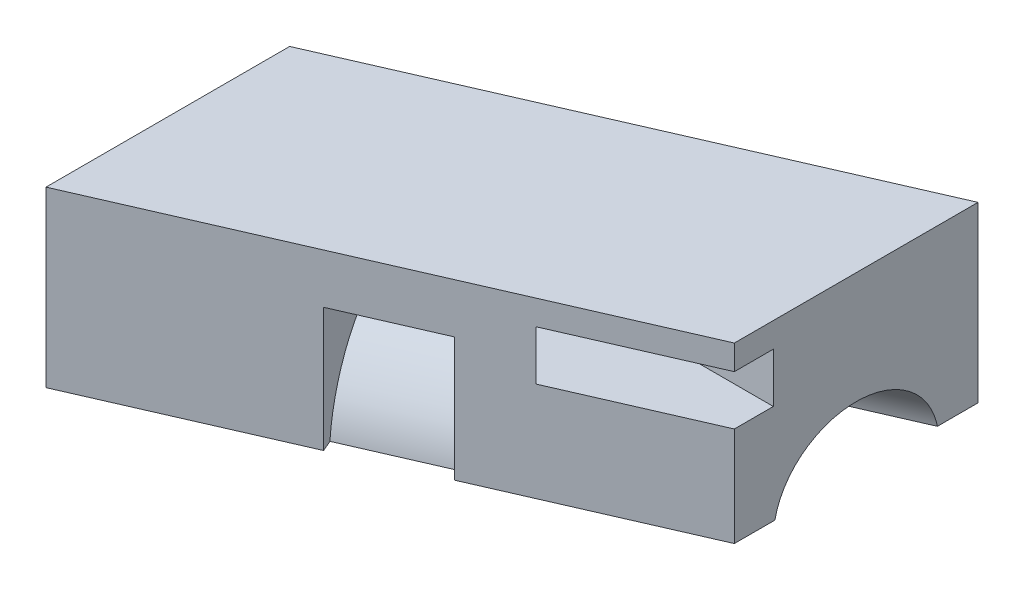
ISO-10303-21;
HEADER;
FILE_DESCRIPTION(('STEP AP214'),'2;1');
FILE_NAME('part.step','',(''),(''),'','','');
FILE_SCHEMA(('AUTOMOTIVE_DESIGN { 1 0 10303 214 1 1 1 1 }'));
ENDSEC;
DATA;
#1=APPLICATION_CONTEXT('core data for automotive mechanical design processes');
#2=APPLICATION_PROTOCOL_DEFINITION('international standard','automotive_design',2000,#1);
#3=PRODUCT_CONTEXT('',#1,'mechanical');
#4=PRODUCT('Part','Part','',(#3));
#5=PRODUCT_RELATED_PRODUCT_CATEGORY('part','',(#4));
#6=PRODUCT_DEFINITION_FORMATION('','',#4);
#7=PRODUCT_DEFINITION_CONTEXT('part definition',#1,'design');
#8=PRODUCT_DEFINITION('design','',#6,#7);
#9=PRODUCT_DEFINITION_SHAPE('','',#8);
#10=(LENGTH_UNIT() NAMED_UNIT(*) SI_UNIT(.MILLI.,.METRE.));
#11=(NAMED_UNIT(*) PLANE_ANGLE_UNIT() SI_UNIT($,.RADIAN.));
#12=(NAMED_UNIT(*) SI_UNIT($,.STERADIAN.) SOLID_ANGLE_UNIT());
#13=UNCERTAINTY_MEASURE_WITH_UNIT(LENGTH_MEASURE(1.E-05),#10,'distance_accuracy_value','');
#14=(GEOMETRIC_REPRESENTATION_CONTEXT(3) GLOBAL_UNCERTAINTY_ASSIGNED_CONTEXT((#13)) GLOBAL_UNIT_ASSIGNED_CONTEXT((#10,
#11,#12)) REPRESENTATION_CONTEXT('',''));
#15=CARTESIAN_POINT('',(0.,0.,0.));
#16=DIRECTION('',(0.,0.,1.));
#17=DIRECTION('',(1.,0.,0.));
#18=AXIS2_PLACEMENT_3D('',#15,#16,#17);
#19=CARTESIAN_POINT('',(0.,-7.,0.));
#20=DIRECTION('',(0.,1.,0.));
#21=DIRECTION('',(0.,0.,-1.));
#22=AXIS2_PLACEMENT_3D('',#19,#20,#21);
#23=PLANE('',#22);
#24=DIRECTION('',(0.,0.,-1.));
#25=VECTOR('',#24,1.);
#26=CARTESIAN_POINT('',(0.,-7.,0.));
#27=LINE('',#26,#25);
#28=CARTESIAN_POINT('',(0.,-7.,0.));
#29=VERTEX_POINT('',#28);
#30=CARTESIAN_POINT('',(0.,-7.,-1.63663417676994));
#31=VERTEX_POINT('',#30);
#32=EDGE_CURVE('E195',#29,#31,#27,.T.);
#33=ORIENTED_EDGE('',*,*,#32,.T.);
#34=DIRECTION('',(-0.916515138991168,0.,0.4));
#35=VECTOR('',#34,1.);
#36=CARTESIAN_POINT('',(28.2702268782218,-7.,-13.9747727084868));
#37=LINE('',#36,#35);
#38=CARTESIAN_POINT('',(19.3128784747792,-7.,-10.0654653670708));
#39=VERTEX_POINT('',#38);
#40=EDGE_CURVE('E318',#39,#31,#37,.T.);
#41=ORIENTED_EDGE('',*,*,#40,.F.);
#42=DIRECTION('',(0.,0.,1.));
#43=VECTOR('',#42,1.);
#44=CARTESIAN_POINT('',(19.3128784747792,-7.,-18.2486362509205));
#45=LINE('',#44,#43);
#46=CARTESIAN_POINT('',(19.3128784747792,-7.,-8.42883119030086));
#47=VERTEX_POINT('',#46);
#48=EDGE_CURVE('E227',#39,#47,#45,.T.);
#49=ORIENTED_EDGE('',*,*,#48,.T.);
#50=DIRECTION('',(0.916515138991168,0.,-0.4));
#51=VECTOR('',#50,1.);
#52=CARTESIAN_POINT('',(22.9128784747792,-7.,-10.));
#53=LINE('',#52,#51);
#54=CARTESIAN_POINT('',(11.4564392373896,-7.,-5.00000000000001));
#55=VERTEX_POINT('',#54);
#56=EDGE_CURVE('E200',#55,#47,#53,.T.);
#57=ORIENTED_EDGE('',*,*,#56,.F.);
#58=DIRECTION('',(0.4,0.,0.916515138991168));
#59=VECTOR('',#58,1.);
#60=CARTESIAN_POINT('',(11.2614314492087,-7.,-5.44681897522243));
#61=LINE('',#60,#59);
#62=CARTESIAN_POINT('',(11.2614314492087,-7.,-5.44681897522243));
#63=VERTEX_POINT('',#62);
#64=EDGE_CURVE('E302',#63,#55,#61,.T.);
#65=ORIENTED_EDGE('',*,*,#64,.F.);
#66=DIRECTION('',(0.916515138991168,0.,-0.4));
#67=VECTOR('',#66,1.);
#68=CARTESIAN_POINT('',(7.59537089324404,-7.,-3.84681897522243));
#69=LINE('',#68,#67);
#70=CARTESIAN_POINT('',(7.59537089324404,-7.,-3.84681897522243));
#71=VERTEX_POINT('',#70);
#72=EDGE_CURVE('E300',#71,#63,#69,.T.);
#73=ORIENTED_EDGE('',*,*,#72,.F.);
#74=DIRECTION('',(0.4,0.,0.916515138991168));
#75=VECTOR('',#74,1.);
#76=CARTESIAN_POINT('',(7.59537089324404,-7.,-3.84681897522243));
#77=LINE('',#76,#75);
#78=CARTESIAN_POINT('',(7.79037868142493,-7.,-3.40000000000001));
#79=VERTEX_POINT('',#78);
#80=EDGE_CURVE('E198',#71,#79,#77,.T.);
#81=ORIENTED_EDGE('',*,*,#80,.T.);
#82=EDGE_CURVE('E182',#29,#79,#53,.T.);
#83=ORIENTED_EDGE('',*,*,#82,.F.);
#84=EDGE_LOOP('',(#33,#41,#49,#57,#65,#73,#81,#83));
#85=FACE_BOUND('',#84,.T.);
#86=ADVANCED_FACE('F32',(#85),#23,.F.);
#87=CARTESIAN_POINT('',(0.,-7.,-8.18317088384971));
#88=VERTEX_POINT('',#87);
#89=CARTESIAN_POINT('',(0.,-7.,-9.81980506061964));
#90=VERTEX_POINT('',#89);
#91=EDGE_CURVE('E207',#88,#90,#27,.T.);
#92=ORIENTED_EDGE('',*,*,#91,.T.);
#93=DIRECTION('',(-0.916515138991168,0.,0.4));
#94=VECTOR('',#93,1.);
#95=CARTESIAN_POINT('',(-3.6,-7.,-8.2486362509205));
#96=LINE('',#95,#94);
#97=CARTESIAN_POINT('',(4.19037868142494,-7.,-11.6486362509205));
#98=VERTEX_POINT('',#97);
#99=EDGE_CURVE('E199',#98,#90,#96,.T.);
#100=ORIENTED_EDGE('',*,*,#99,.F.);
#101=DIRECTION('',(0.400000000000001,0.,0.916515138991168));
#102=VECTOR('',#101,1.);
#103=CARTESIAN_POINT('',(4.38538646960582,-7.,-11.2018172756981));
#104=LINE('',#103,#102);
#105=CARTESIAN_POINT('',(4.38538646960582,-7.,-11.2018172756981));
#106=VERTEX_POINT('',#105);
#107=EDGE_CURVE('E297',#98,#106,#104,.T.);
#108=ORIENTED_EDGE('',*,*,#107,.T.);
#109=DIRECTION('',(0.916515138991168,0.,-0.4));
#110=VECTOR('',#109,1.);
#111=CARTESIAN_POINT('',(4.38538646960582,-7.,-11.2018172756981));
#112=LINE('',#111,#110);
#113=CARTESIAN_POINT('',(8.05144702557049,-7.,-12.8018172756981));
#114=VERTEX_POINT('',#113);
#115=EDGE_CURVE('E315',#106,#114,#112,.T.);
#116=ORIENTED_EDGE('',*,*,#115,.T.);
#117=DIRECTION('',(0.400000000000001,0.,0.916515138991168));
#118=VECTOR('',#117,1.);
#119=CARTESIAN_POINT('',(8.05144702557049,-7.,-12.8018172756981));
#120=LINE('',#119,#118);
#121=CARTESIAN_POINT('',(7.85643923738961,-7.,-13.2486362509205));
#122=VERTEX_POINT('',#121);
#123=EDGE_CURVE('E288',#122,#114,#120,.T.);
#124=ORIENTED_EDGE('',*,*,#123,.F.);
#125=CARTESIAN_POINT('',(19.3128784747792,-7.,-18.2486362509205));
#126=VERTEX_POINT('',#125);
#127=EDGE_CURVE('E190',#126,#122,#96,.T.);
#128=ORIENTED_EDGE('',*,*,#127,.F.);
#129=CARTESIAN_POINT('',(19.3128784747792,-7.,-16.6120020741506));
#130=VERTEX_POINT('',#129);
#131=EDGE_CURVE('E223',#126,#130,#45,.T.);
#132=ORIENTED_EDGE('',*,*,#131,.T.);
#133=DIRECTION('',(-0.916515138991168,0.,0.4));
#134=VECTOR('',#133,1.);
#135=CARTESIAN_POINT('',(25.8702268782218,-7.,-19.4738635424338));
#136=LINE('',#135,#134);
#137=EDGE_CURVE('E327',#130,#88,#136,.T.);
#138=ORIENTED_EDGE('',*,*,#137,.T.);
#139=EDGE_LOOP('',(#92,#100,#108,#116,#124,#128,#132,#138));
#140=FACE_BOUND('',#139,.T.);
#141=ADVANCED_FACE('F393',(#140),#23,.F.);
#142=CARTESIAN_POINT('',(0.,0.,0.));
#143=DIRECTION('',(0.,1.,0.));
#144=DIRECTION('',(0.,0.,-1.));
#145=AXIS2_PLACEMENT_3D('',#142,#143,#144);
#146=PLANE('',#145);
#147=DIRECTION('',(0.916515138991168,0.,-0.4));
#148=VECTOR('',#147,1.);
#149=CARTESIAN_POINT('',(22.9128784747792,0.,-10.));
#150=LINE('',#149,#148);
#151=CARTESIAN_POINT('',(0.,0.,0.));
#152=VERTEX_POINT('',#151);
#153=CARTESIAN_POINT('',(19.3128784747792,0.,-8.42883119030086));
#154=VERTEX_POINT('',#153);
#155=EDGE_CURVE('E185',#152,#154,#150,.T.);
#156=ORIENTED_EDGE('',*,*,#155,.T.);
#157=DIRECTION('',(0.,0.,1.));
#158=VECTOR('',#157,1.);
#159=CARTESIAN_POINT('',(19.3128784747792,0.,-18.2486362509205));
#160=LINE('',#159,#158);
#161=CARTESIAN_POINT('',(19.3128784747792,0.,-18.2486362509205));
#162=VERTEX_POINT('',#161);
#163=EDGE_CURVE('E222',#162,#154,#160,.T.);
#164=ORIENTED_EDGE('',*,*,#163,.F.);
#165=DIRECTION('',(-0.916515138991168,0.,0.4));
#166=VECTOR('',#165,1.);
#167=CARTESIAN_POINT('',(-3.6,0.,-8.2486362509205));
#168=LINE('',#167,#166);
#169=CARTESIAN_POINT('',(0.,0.,-9.81980506061964));
#170=VERTEX_POINT('',#169);
#171=EDGE_CURVE('E334',#162,#170,#168,.T.);
#172=ORIENTED_EDGE('',*,*,#171,.T.);
#173=DIRECTION('',(0.,0.,-1.));
#174=VECTOR('',#173,1.);
#175=CARTESIAN_POINT('',(0.,0.,0.));
#176=LINE('',#175,#174);
#177=EDGE_CURVE('E212',#152,#170,#176,.T.);
#178=ORIENTED_EDGE('',*,*,#177,.F.);
#179=EDGE_LOOP('',(#156,#164,#172,#178));
#180=FACE_BOUND('',#179,.T.);
#181=ADVANCED_FACE('F397',(#180),#146,.T.);
#182=CARTESIAN_POINT('',(27.0702268782218,-7.54999999999999,-16.7243181254603));
#183=DIRECTION('',(-0.916515138991168,0.,0.4));
#184=DIRECTION('',(0.4,0.,0.916515138991168));
#185=AXIS2_PLACEMENT_3D('',#182,#183,#184);
#186=CYLINDRICAL_SURFACE('',#185,3.04999999999999);
#187=CARTESIAN_POINT('',(0.,-7.54999999999999,-4.90990253030982));
#188=DIRECTION('',(1.,0.,0.));
#189=DIRECTION('',(0.,0.,1.));
#190=AXIS2_PLACEMENT_3D('',#187,#188,#189);
#191=ELLIPSE('',#190,3.32782282609888,3.04999999999999);
#192=EDGE_CURVE('E204',#31,#88,#191,.F.);
#193=ORIENTED_EDGE('',*,*,#192,.T.);
#194=ORIENTED_EDGE('',*,*,#137,.F.);
#195=CARTESIAN_POINT('',(19.3128784747792,-7.54999999999999,-13.3387337206107));
#196=DIRECTION('',(-1.,0.,0.));
#197=DIRECTION('',(0.,0.,1.));
#198=AXIS2_PLACEMENT_3D('',#195,#196,#197);
#199=ELLIPSE('',#198,3.32782282609888,3.04999999999999);
#200=EDGE_CURVE('E238',#130,#39,#199,.F.);
#201=ORIENTED_EDGE('',*,*,#200,.T.);
#202=ORIENTED_EDGE('',*,*,#40,.T.);
#203=EDGE_LOOP('',(#193,#194,#201,#202));
#204=FACE_BOUND('',#203,.T.);
#205=ADVANCED_FACE('F387',(#204),#186,.F.);
#206=CARTESIAN_POINT('',(-3.6,-1.,-6.));
#207=DIRECTION('',(0.,1.,0.));
#208=DIRECTION('',(0.,0.,-1.));
#209=AXIS2_PLACEMENT_3D('',#206,#207,#208);
#210=PLANE('',#209);
#211=DIRECTION('',(0.,0.,-1.));
#212=VECTOR('',#211,1.);
#213=CARTESIAN_POINT('',(0.,-1.,-6.));
#214=LINE('',#213,#212);
#215=CARTESIAN_POINT('',(0.,-1.,-6.));
#216=VERTEX_POINT('',#215);
#217=CARTESIAN_POINT('',(0.,-1.,-9.81980506061964));
#218=VERTEX_POINT('',#217);
#219=EDGE_CURVE('E218',#216,#218,#214,.T.);
#220=ORIENTED_EDGE('',*,*,#219,.T.);
#221=DIRECTION('',(0.916515138991168,0.,-0.4));
#222=VECTOR('',#221,1.);
#223=CARTESIAN_POINT('',(-3.6,-0.999999999999999,-8.2486362509205));
#224=LINE('',#223,#222);
#225=CARTESIAN_POINT('',(0.412878474779229,-1.,-10.));
#226=VERTEX_POINT('',#225);
#227=EDGE_CURVE('E279',#218,#226,#224,.T.);
#228=ORIENTED_EDGE('',*,*,#227,.T.);
#229=DIRECTION('',(1.,0.,0.));
#230=VECTOR('',#229,1.);
#231=CARTESIAN_POINT('',(-3.6,-1.,-10.));
#232=LINE('',#231,#230);
#233=CARTESIAN_POINT('',(19.3128784747792,-1.,-10.));
#234=VERTEX_POINT('',#233);
#235=EDGE_CURVE('E248',#226,#234,#232,.T.);
#236=ORIENTED_EDGE('',*,*,#235,.T.);
#237=DIRECTION('',(0.,0.,1.));
#238=VECTOR('',#237,1.);
#239=CARTESIAN_POINT('',(19.3128784747792,-1.,-6.));
#240=LINE('',#239,#238);
#241=CARTESIAN_POINT('',(19.3128784747792,-1.,-8.42883119030086));
#242=VERTEX_POINT('',#241);
#243=EDGE_CURVE('E235',#234,#242,#240,.T.);
#244=ORIENTED_EDGE('',*,*,#243,.T.);
#245=DIRECTION('',(-0.916515138991168,0.,0.4));
#246=VECTOR('',#245,1.);
#247=CARTESIAN_POINT('',(22.9128784747792,-1.,-10.));
#248=LINE('',#247,#246);
#249=CARTESIAN_POINT('',(13.7477270848675,-1.,-6.));
#250=VERTEX_POINT('',#249);
#251=EDGE_CURVE('E282',#242,#250,#248,.T.);
#252=ORIENTED_EDGE('',*,*,#251,.T.);
#253=DIRECTION('',(1.,0.,0.));
#254=VECTOR('',#253,1.);
#255=CARTESIAN_POINT('',(-3.6,-1.,-6.));
#256=LINE('',#255,#254);
#257=EDGE_CURVE('E240',#216,#250,#256,.T.);
#258=ORIENTED_EDGE('',*,*,#257,.F.);
#259=EDGE_LOOP('',(#220,#228,#236,#244,#252,#258));
#260=FACE_BOUND('',#259,.T.);
#261=ADVANCED_FACE('F353',(#260),#210,.F.);
#262=CARTESIAN_POINT('',(-3.6,-7.,-8.2486362509205));
#263=DIRECTION('',(0.4,0.,0.916515138991168));
#264=DIRECTION('',(0.916515138991168,0.,-0.4));
#265=AXIS2_PLACEMENT_3D('',#262,#263,#264);
#266=PLANE('',#265);
#267=DIRECTION('',(0.,1.,0.));
#268=VECTOR('',#267,1.);
#269=CARTESIAN_POINT('',(0.,-7.,-9.81980506061964));
#270=LINE('',#269,#268);
#271=CARTESIAN_POINT('',(0.,-3.,-9.81980506061964));
#272=VERTEX_POINT('',#271);
#273=EDGE_CURVE('E209',#90,#272,#270,.T.);
#274=ORIENTED_EDGE('',*,*,#273,.T.);
#275=DIRECTION('',(-0.916515138991168,0.,0.4));
#276=VECTOR('',#275,1.);
#277=CARTESIAN_POINT('',(-3.6,-3.,-8.2486362509205));
#278=LINE('',#277,#276);
#279=CARTESIAN_POINT('',(0.412878474779227,-3.,-10.));
#280=VERTEX_POINT('',#279);
#281=EDGE_CURVE('E265',#280,#272,#278,.T.);
#282=ORIENTED_EDGE('',*,*,#281,.F.);
#283=DIRECTION('',(0.,-1.,0.));
#284=VECTOR('',#283,1.);
#285=CARTESIAN_POINT('',(0.412878474779228,-7.,-10.));
#286=LINE('',#285,#284);
#287=EDGE_CURVE('E259',#226,#280,#286,.T.);
#288=ORIENTED_EDGE('',*,*,#287,.F.);
#289=ORIENTED_EDGE('',*,*,#227,.F.);
#290=EDGE_CURVE('E206',#218,#170,#270,.T.);
#291=ORIENTED_EDGE('',*,*,#290,.T.);
#292=ORIENTED_EDGE('',*,*,#171,.F.);
#293=DIRECTION('',(0.,1.,0.));
#294=VECTOR('',#293,1.);
#295=CARTESIAN_POINT('',(19.3128784747792,-7.,-18.2486362509205));
#296=LINE('',#295,#294);
#297=EDGE_CURVE('E189',#126,#162,#296,.T.);
#298=ORIENTED_EDGE('',*,*,#297,.F.);
#299=ORIENTED_EDGE('',*,*,#127,.T.);
#300=DIRECTION('',(0.,-1.,0.));
#301=VECTOR('',#300,1.);
#302=CARTESIAN_POINT('',(7.85643923738961,-7.,-13.2486362509205));
#303=LINE('',#302,#301);
#304=CARTESIAN_POINT('',(7.85643923738961,-1.99999999999999,-13.2486362509205));
#305=VERTEX_POINT('',#304);
#306=EDGE_CURVE('E311',#305,#122,#303,.T.);
#307=ORIENTED_EDGE('',*,*,#306,.F.);
#308=DIRECTION('',(0.916515138991168,0.,-0.4));
#309=VECTOR('',#308,1.);
#310=CARTESIAN_POINT('',(4.19037868142494,-1.99999999999999,-11.6486362509205));
#311=LINE('',#310,#309);
#312=CARTESIAN_POINT('',(4.19037868142494,-1.99999999999999,-11.6486362509205));
#313=VERTEX_POINT('',#312);
#314=EDGE_CURVE('E319',#313,#305,#311,.T.);
#315=ORIENTED_EDGE('',*,*,#314,.F.);
#316=DIRECTION('',(0.,-1.,0.));
#317=VECTOR('',#316,1.);
#318=CARTESIAN_POINT('',(4.19037868142494,-7.,-11.6486362509205));
#319=LINE('',#318,#317);
#320=EDGE_CURVE('E295',#313,#98,#319,.T.);
#321=ORIENTED_EDGE('',*,*,#320,.T.);
#322=ORIENTED_EDGE('',*,*,#99,.T.);
#323=EDGE_LOOP('',(#274,#282,#288,#289,#291,#292,#298,#299,#307,#315,#321,#322));
#324=FACE_BOUND('',#323,.T.);
#325=ADVANCED_FACE('F358',(#324),#266,.F.);
#326=CARTESIAN_POINT('',(-3.6,-1.,-6.));
#327=DIRECTION('',(0.,0.,1.));
#328=DIRECTION('',(1.,0.,0.));
#329=AXIS2_PLACEMENT_3D('',#326,#327,#328);
#330=PLANE('',#329);
#331=DIRECTION('',(0.,1.,0.));
#332=VECTOR('',#331,1.);
#333=CARTESIAN_POINT('',(0.,-1.,-6.));
#334=LINE('',#333,#332);
#335=CARTESIAN_POINT('',(0.,-3.,-6.));
#336=VERTEX_POINT('',#335);
#337=EDGE_CURVE('E216',#336,#216,#334,.T.);
#338=ORIENTED_EDGE('',*,*,#337,.T.);
#339=ORIENTED_EDGE('',*,*,#257,.T.);
#340=DIRECTION('',(0.,-1.,0.));
#341=VECTOR('',#340,1.);
#342=CARTESIAN_POINT('',(13.7477270848675,-7.,-6.));
#343=LINE('',#342,#341);
#344=CARTESIAN_POINT('',(13.7477270848675,-3.,-6.));
#345=VERTEX_POINT('',#344);
#346=EDGE_CURVE('E276',#250,#345,#343,.T.);
#347=ORIENTED_EDGE('',*,*,#346,.T.);
#348=DIRECTION('',(1.,0.,0.));
#349=VECTOR('',#348,1.);
#350=CARTESIAN_POINT('',(-3.6,-3.,-6.));
#351=LINE('',#350,#349);
#352=CARTESIAN_POINT('',(11.0200034569176,-3.,-6.));
#353=VERTEX_POINT('',#352);
#354=EDGE_CURVE('E241',#353,#345,#351,.T.);
#355=ORIENTED_EDGE('',*,*,#354,.F.);
#356=DIRECTION('',(0.,-1.,0.));
#357=VECTOR('',#356,1.);
#358=CARTESIAN_POINT('',(11.0200034569176,-7.54999999999999,-6.));
#359=LINE('',#358,#357);
#360=CARTESIAN_POINT('',(11.0200034569176,-1.99999999999999,-6.));
#361=VERTEX_POINT('',#360);
#362=EDGE_CURVE('E344',#361,#353,#359,.T.);
#363=ORIENTED_EDGE('',*,*,#362,.F.);
#364=DIRECTION('',(-1.,0.,0.));
#365=VECTOR('',#364,1.);
#366=CARTESIAN_POINT('',(7.79037868142493,-1.99999999999999,-6.));
#367=LINE('',#366,#365);
#368=CARTESIAN_POINT('',(6.65564565219777,-1.99999999999999,-6.));
#369=VERTEX_POINT('',#368);
#370=EDGE_CURVE('E270',#361,#369,#367,.T.);
#371=ORIENTED_EDGE('',*,*,#370,.T.);
#372=DIRECTION('',(0.,-1.,0.));
#373=VECTOR('',#372,1.);
#374=CARTESIAN_POINT('',(6.65564565219777,-7.54999999999999,-6.));
#375=LINE('',#374,#373);
#376=CARTESIAN_POINT('',(6.65564565219777,-3.,-6.));
#377=VERTEX_POINT('',#376);
#378=EDGE_CURVE('E273',#369,#377,#375,.T.);
#379=ORIENTED_EDGE('',*,*,#378,.T.);
#380=EDGE_CURVE('E244',#336,#377,#351,.T.);
#381=ORIENTED_EDGE('',*,*,#380,.F.);
#382=EDGE_LOOP('',(#338,#339,#347,#355,#363,#371,#379,#381));
#383=FACE_BOUND('',#382,.T.);
#384=ADVANCED_FACE('F399',(#383),#330,.F.);
#385=CARTESIAN_POINT('',(-3.6,-3.,-6.));
#386=DIRECTION('',(0.,-1.,0.));
#387=DIRECTION('',(0.,0.,1.));
#388=AXIS2_PLACEMENT_3D('',#385,#386,#387);
#389=PLANE('',#388);
#390=DIRECTION('',(0.,0.,1.));
#391=VECTOR('',#390,1.);
#392=CARTESIAN_POINT('',(0.,-3.,-6.));
#393=LINE('',#392,#391);
#394=EDGE_CURVE('E11',#272,#336,#393,.T.);
#395=ORIENTED_EDGE('',*,*,#394,.T.);
#396=ORIENTED_EDGE('',*,*,#380,.T.);
#397=DIRECTION('',(-0.4,0.,-0.916515138991168));
#398=VECTOR('',#397,1.);
#399=CARTESIAN_POINT('',(5.99037868142493,-3.,-7.52431812546026));
#400=LINE('',#399,#398);
#401=CARTESIAN_POINT('',(4.90990253030983,-3.,-10.));
#402=VERTEX_POINT('',#401);
#403=EDGE_CURVE('E262',#377,#402,#400,.T.);
#404=ORIENTED_EDGE('',*,*,#403,.T.);
#405=DIRECTION('',(1.,0.,0.));
#406=VECTOR('',#405,1.);
#407=CARTESIAN_POINT('',(-3.6,-3.,-10.));
#408=LINE('',#407,#406);
#409=EDGE_CURVE('E245',#280,#402,#408,.T.);
#410=ORIENTED_EDGE('',*,*,#409,.F.);
#411=ORIENTED_EDGE('',*,*,#281,.T.);
#412=EDGE_LOOP('',(#395,#396,#404,#410,#411));
#413=FACE_BOUND('',#412,.T.);
#414=ADVANCED_FACE('F364',(#413),#389,.F.);
#415=CARTESIAN_POINT('',(22.9128784747792,-7.,-10.));
#416=DIRECTION('',(-0.4,0.,-0.916515138991168));
#417=DIRECTION('',(-0.916515138991168,0.,0.4));
#418=AXIS2_PLACEMENT_3D('',#415,#416,#417);
#419=PLANE('',#418);
#420=DIRECTION('',(0.,1.,0.));
#421=VECTOR('',#420,1.);
#422=CARTESIAN_POINT('',(19.3128784747792,-7.,-8.42883119030086));
#423=LINE('',#422,#421);
#424=CARTESIAN_POINT('',(19.3128784747792,-3.,-8.42883119030086));
#425=VERTEX_POINT('',#424);
#426=EDGE_CURVE('E230',#47,#425,#423,.T.);
#427=ORIENTED_EDGE('',*,*,#426,.T.);
#428=DIRECTION('',(0.916515138991168,0.,-0.4));
#429=VECTOR('',#428,1.);
#430=CARTESIAN_POINT('',(22.9128784747792,-3.,-10.));
#431=LINE('',#430,#429);
#432=EDGE_CURVE('E267',#345,#425,#431,.T.);
#433=ORIENTED_EDGE('',*,*,#432,.F.);
#434=ORIENTED_EDGE('',*,*,#346,.F.);
#435=ORIENTED_EDGE('',*,*,#251,.F.);
#436=EDGE_CURVE('E226',#242,#154,#423,.T.);
#437=ORIENTED_EDGE('',*,*,#436,.T.);
#438=ORIENTED_EDGE('',*,*,#155,.F.);
#439=DIRECTION('',(0.,1.,0.));
#440=VECTOR('',#439,1.);
#441=CARTESIAN_POINT('',(0.,-7.,0.));
#442=LINE('',#441,#440);
#443=EDGE_CURVE('E178',#29,#152,#442,.T.);
#444=ORIENTED_EDGE('',*,*,#443,.F.);
#445=ORIENTED_EDGE('',*,*,#82,.T.);
#446=DIRECTION('',(0.,1.,0.));
#447=VECTOR('',#446,1.);
#448=CARTESIAN_POINT('',(7.79037868142493,-7.,-3.40000000000001));
#449=LINE('',#448,#447);
#450=CARTESIAN_POINT('',(7.79037868142493,-1.99999999999999,-3.40000000000001));
#451=VERTEX_POINT('',#450);
#452=EDGE_CURVE('E290',#79,#451,#449,.T.);
#453=ORIENTED_EDGE('',*,*,#452,.T.);
#454=DIRECTION('',(0.916515138991168,0.,-0.4));
#455=VECTOR('',#454,1.);
#456=CARTESIAN_POINT('',(7.79037868142493,-1.99999999999999,-3.40000000000001));
#457=LINE('',#456,#455);
#458=CARTESIAN_POINT('',(11.4564392373896,-1.99999999999999,-5.));
#459=VERTEX_POINT('',#458);
#460=EDGE_CURVE('E322',#451,#459,#457,.T.);
#461=ORIENTED_EDGE('',*,*,#460,.T.);
#462=DIRECTION('',(0.,1.,0.));
#463=VECTOR('',#462,1.);
#464=CARTESIAN_POINT('',(11.4564392373896,-7.,-5.00000000000001));
#465=LINE('',#464,#463);
#466=EDGE_CURVE('E305',#55,#459,#465,.T.);
#467=ORIENTED_EDGE('',*,*,#466,.F.);
#468=ORIENTED_EDGE('',*,*,#56,.T.);
#469=EDGE_LOOP('',(#427,#433,#434,#435,#437,#438,#444,#445,#453,#461,#467,#468));
#470=FACE_BOUND('',#469,.T.);
#471=ADVANCED_FACE('F34',(#470),#419,.F.);
#472=DIRECTION('',(0.,0.,-1.));
#473=VECTOR('',#472,1.);
#474=CARTESIAN_POINT('',(19.3128784747792,-3.,-6.));
#475=LINE('',#474,#473);
#476=CARTESIAN_POINT('',(19.3128784747792,-3.,-10.));
#477=VERTEX_POINT('',#476);
#478=EDGE_CURVE('E232',#425,#477,#475,.T.);
#479=ORIENTED_EDGE('',*,*,#478,.T.);
#480=CARTESIAN_POINT('',(9.27426033502968,-3.,-10.));
#481=VERTEX_POINT('',#480);
#482=EDGE_CURVE('E246',#481,#477,#408,.T.);
#483=ORIENTED_EDGE('',*,*,#482,.F.);
#484=DIRECTION('',(-0.4,0.,-0.916515138991168));
#485=VECTOR('',#484,1.);
#486=CARTESIAN_POINT('',(9.6564392373896,-3.,-9.12431812546026));
#487=LINE('',#486,#485);
#488=EDGE_CURVE('E341',#353,#481,#487,.T.);
#489=ORIENTED_EDGE('',*,*,#488,.F.);
#490=ORIENTED_EDGE('',*,*,#354,.T.);
#491=ORIENTED_EDGE('',*,*,#432,.T.);
#492=EDGE_LOOP('',(#479,#483,#489,#490,#491));
#493=FACE_BOUND('',#492,.T.);
#494=ADVANCED_FACE('F380',(#493),#389,.F.);
#495=CARTESIAN_POINT('',(-3.6,-1.,-10.));
#496=DIRECTION('',(0.,0.,-1.));
#497=DIRECTION('',(-1.,0.,0.));
#498=AXIS2_PLACEMENT_3D('',#495,#496,#497);
#499=PLANE('',#498);
#500=DIRECTION('',(0.,1.,0.));
#501=VECTOR('',#500,1.);
#502=CARTESIAN_POINT('',(19.3128784747792,-1.,-10.));
#503=LINE('',#502,#501);
#504=EDGE_CURVE('E40',#477,#234,#503,.T.);
#505=ORIENTED_EDGE('',*,*,#504,.T.);
#506=ORIENTED_EDGE('',*,*,#235,.F.);
#507=ORIENTED_EDGE('',*,*,#287,.T.);
#508=ORIENTED_EDGE('',*,*,#409,.T.);
#509=DIRECTION('',(0.,1.,0.));
#510=VECTOR('',#509,1.);
#511=CARTESIAN_POINT('',(4.90990253030983,-7.54999999999999,-10.));
#512=LINE('',#511,#510);
#513=CARTESIAN_POINT('',(4.90990253030983,-1.99999999999999,-10.));
#514=VERTEX_POINT('',#513);
#515=EDGE_CURVE('E256',#402,#514,#512,.T.);
#516=ORIENTED_EDGE('',*,*,#515,.T.);
#517=DIRECTION('',(1.,0.,0.));
#518=VECTOR('',#517,1.);
#519=CARTESIAN_POINT('',(7.79037868142493,-1.99999999999999,-10.));
#520=LINE('',#519,#518);
#521=CARTESIAN_POINT('',(9.27426033502968,-1.99999999999999,-10.));
#522=VERTEX_POINT('',#521);
#523=EDGE_CURVE('E253',#514,#522,#520,.T.);
#524=ORIENTED_EDGE('',*,*,#523,.T.);
#525=DIRECTION('',(0.,1.,0.));
#526=VECTOR('',#525,1.);
#527=CARTESIAN_POINT('',(9.27426033502968,-7.54999999999999,-10.));
#528=LINE('',#527,#526);
#529=EDGE_CURVE('E338',#481,#522,#528,.T.);
#530=ORIENTED_EDGE('',*,*,#529,.F.);
#531=ORIENTED_EDGE('',*,*,#482,.T.);
#532=EDGE_LOOP('',(#505,#506,#507,#508,#516,#524,#530,#531));
#533=FACE_BOUND('',#532,.T.);
#534=ADVANCED_FACE('F348',(#533),#499,.F.);
#535=CARTESIAN_POINT('',(7.79037868142493,-1.99999999999999,-3.40000000000001));
#536=DIRECTION('',(0.,1.,0.));
#537=DIRECTION('',(0.,0.,-1.));
#538=AXIS2_PLACEMENT_3D('',#535,#536,#537);
#539=PLANE('',#538);
#540=DIRECTION('',(-0.4,0.,-0.916515138991168));
#541=VECTOR('',#540,1.);
#542=CARTESIAN_POINT('',(11.4564392373896,-1.99999999999999,-5.00000000000001));
#543=LINE('',#542,#541);
#544=EDGE_CURVE('E309',#459,#361,#543,.T.);
#545=ORIENTED_EDGE('',*,*,#544,.F.);
#546=ORIENTED_EDGE('',*,*,#460,.F.);
#547=DIRECTION('',(-0.4,0.,-0.916515138991168));
#548=VECTOR('',#547,1.);
#549=CARTESIAN_POINT('',(7.79037868142493,-1.99999999999999,-3.40000000000001));
#550=LINE('',#549,#548);
#551=EDGE_CURVE('E293',#451,#369,#550,.T.);
#552=ORIENTED_EDGE('',*,*,#551,.T.);
#553=ORIENTED_EDGE('',*,*,#370,.F.);
#554=EDGE_LOOP('',(#545,#546,#552,#553));
#555=FACE_BOUND('',#554,.T.);
#556=ADVANCED_FACE('F402',(#555),#539,.F.);
#557=CARTESIAN_POINT('',(5.99037868142493,-7.54999999999999,-7.52431812546026));
#558=DIRECTION('',(0.916515138991168,0.,-0.4));
#559=DIRECTION('',(-0.4,0.,-0.916515138991168));
#560=AXIS2_PLACEMENT_3D('',#557,#558,#559);
#561=CYLINDRICAL_SURFACE('',#560,4.05);
#562=CARTESIAN_POINT('',(9.6564392373896,-7.54999999999999,-9.12431812546026));
#563=DIRECTION('',(0.916515138991168,0.,-0.4));
#564=DIRECTION('',(0.4,0.,0.916515138991168));
#565=AXIS2_PLACEMENT_3D('',#562,#563,#564);
#566=CIRCLE('',#565,4.05);
#567=EDGE_CURVE('E285',#114,#63,#566,.T.);
#568=ORIENTED_EDGE('',*,*,#567,.F.);
#569=ORIENTED_EDGE('',*,*,#115,.F.);
#570=CARTESIAN_POINT('',(5.99037868142493,-7.54999999999999,-7.52431812546026));
#571=DIRECTION('',(0.916515138991168,0.,-0.4));
#572=DIRECTION('',(0.4,0.,0.916515138991168));
#573=AXIS2_PLACEMENT_3D('',#570,#571,#572);
#574=CIRCLE('',#573,4.05);
#575=EDGE_CURVE('E286',#106,#71,#574,.T.);
#576=ORIENTED_EDGE('',*,*,#575,.T.);
#577=ORIENTED_EDGE('',*,*,#72,.T.);
#578=EDGE_LOOP('',(#568,#569,#576,#577));
#579=FACE_BOUND('',#578,.T.);
#580=ADVANCED_FACE('F406',(#579),#561,.T.);
#581=EDGE_CURVE('E292',#514,#313,#550,.T.);
#582=ORIENTED_EDGE('',*,*,#581,.T.);
#583=ORIENTED_EDGE('',*,*,#314,.T.);
#584=EDGE_CURVE('E308',#522,#305,#543,.T.);
#585=ORIENTED_EDGE('',*,*,#584,.F.);
#586=ORIENTED_EDGE('',*,*,#523,.F.);
#587=EDGE_LOOP('',(#582,#583,#585,#586));
#588=FACE_BOUND('',#587,.T.);
#589=ADVANCED_FACE('F374',(#588),#539,.F.);
#590=CARTESIAN_POINT('',(5.99037868142493,-7.54999999999999,-7.52431812546026));
#591=DIRECTION('',(-0.916515138991168,0.,0.4));
#592=DIRECTION('',(0.4,0.,0.916515138991168));
#593=AXIS2_PLACEMENT_3D('',#590,#591,#592);
#594=PLANE('',#593);
#595=ORIENTED_EDGE('',*,*,#551,.F.);
#596=ORIENTED_EDGE('',*,*,#452,.F.);
#597=ORIENTED_EDGE('',*,*,#80,.F.);
#598=ORIENTED_EDGE('',*,*,#575,.F.);
#599=ORIENTED_EDGE('',*,*,#107,.F.);
#600=ORIENTED_EDGE('',*,*,#320,.F.);
#601=ORIENTED_EDGE('',*,*,#581,.F.);
#602=ORIENTED_EDGE('',*,*,#515,.F.);
#603=ORIENTED_EDGE('',*,*,#403,.F.);
#604=ORIENTED_EDGE('',*,*,#378,.F.);
#605=EDGE_LOOP('',(#595,#596,#597,#598,#599,#600,#601,#602,#603,#604));
#606=FACE_BOUND('',#605,.T.);
#607=ADVANCED_FACE('F368',(#606),#594,.F.);
#608=CARTESIAN_POINT('',(9.6564392373896,-7.54999999999999,-9.12431812546026));
#609=DIRECTION('',(-0.916515138991168,0.,0.4));
#610=DIRECTION('',(0.4,0.,0.916515138991168));
#611=AXIS2_PLACEMENT_3D('',#608,#609,#610);
#612=PLANE('',#611);
#613=ORIENTED_EDGE('',*,*,#362,.T.);
#614=ORIENTED_EDGE('',*,*,#488,.T.);
#615=ORIENTED_EDGE('',*,*,#529,.T.);
#616=ORIENTED_EDGE('',*,*,#584,.T.);
#617=ORIENTED_EDGE('',*,*,#306,.T.);
#618=ORIENTED_EDGE('',*,*,#123,.T.);
#619=ORIENTED_EDGE('',*,*,#567,.T.);
#620=ORIENTED_EDGE('',*,*,#64,.T.);
#621=ORIENTED_EDGE('',*,*,#466,.T.);
#622=ORIENTED_EDGE('',*,*,#544,.T.);
#623=EDGE_LOOP('',(#613,#614,#615,#616,#617,#618,#619,#620,#621,#622));
#624=FACE_BOUND('',#623,.T.);
#625=ADVANCED_FACE('F376',(#624),#612,.T.);
#626=CARTESIAN_POINT('',(19.3128784747792,-7.,-18.2486362509205));
#627=DIRECTION('',(1.,0.,0.));
#628=DIRECTION('',(0.,0.,-1.));
#629=AXIS2_PLACEMENT_3D('',#626,#627,#628);
#630=PLANE('',#629);
#631=ORIENTED_EDGE('',*,*,#200,.F.);
#632=ORIENTED_EDGE('',*,*,#131,.F.);
#633=ORIENTED_EDGE('',*,*,#297,.T.);
#634=ORIENTED_EDGE('',*,*,#163,.T.);
#635=ORIENTED_EDGE('',*,*,#436,.F.);
#636=ORIENTED_EDGE('',*,*,#243,.F.);
#637=ORIENTED_EDGE('',*,*,#504,.F.);
#638=ORIENTED_EDGE('',*,*,#478,.F.);
#639=ORIENTED_EDGE('',*,*,#426,.F.);
#640=ORIENTED_EDGE('',*,*,#48,.F.);
#641=EDGE_LOOP('',(#631,#632,#633,#634,#635,#636,#637,#638,#639,#640));
#642=FACE_BOUND('',#641,.T.);
#643=ADVANCED_FACE('F350',(#642),#630,.T.);
#644=CARTESIAN_POINT('',(0.,-7.,0.));
#645=DIRECTION('',(-1.,0.,0.));
#646=DIRECTION('',(0.,0.,1.));
#647=AXIS2_PLACEMENT_3D('',#644,#645,#646);
#648=PLANE('',#647);
#649=ORIENTED_EDGE('',*,*,#192,.F.);
#650=ORIENTED_EDGE('',*,*,#32,.F.);
#651=ORIENTED_EDGE('',*,*,#443,.T.);
#652=ORIENTED_EDGE('',*,*,#177,.T.);
#653=ORIENTED_EDGE('',*,*,#290,.F.);
#654=ORIENTED_EDGE('',*,*,#219,.F.);
#655=ORIENTED_EDGE('',*,*,#337,.F.);
#656=ORIENTED_EDGE('',*,*,#394,.F.);
#657=ORIENTED_EDGE('',*,*,#273,.F.);
#658=ORIENTED_EDGE('',*,*,#91,.F.);
#659=EDGE_LOOP('',(#649,#650,#651,#652,#653,#654,#655,#656,#657,#658));
#660=FACE_BOUND('',#659,.T.);
#661=ADVANCED_FACE('F202',(#660),#648,.T.);
#662=CLOSED_SHELL('',(#86,#141,#181,#205,#261,#325,#384,#414,#471,#494,#534,#556,#580,#589,#607,
#625,#643,#661));
#663=MANIFOLD_SOLID_BREP('B2',#662);
#664=ADVANCED_BREP_SHAPE_REPRESENTATION('',(#18,#663),#14);
#665=SHAPE_DEFINITION_REPRESENTATION(#9,#664);
ENDSEC;
END-ISO-10303-21;
